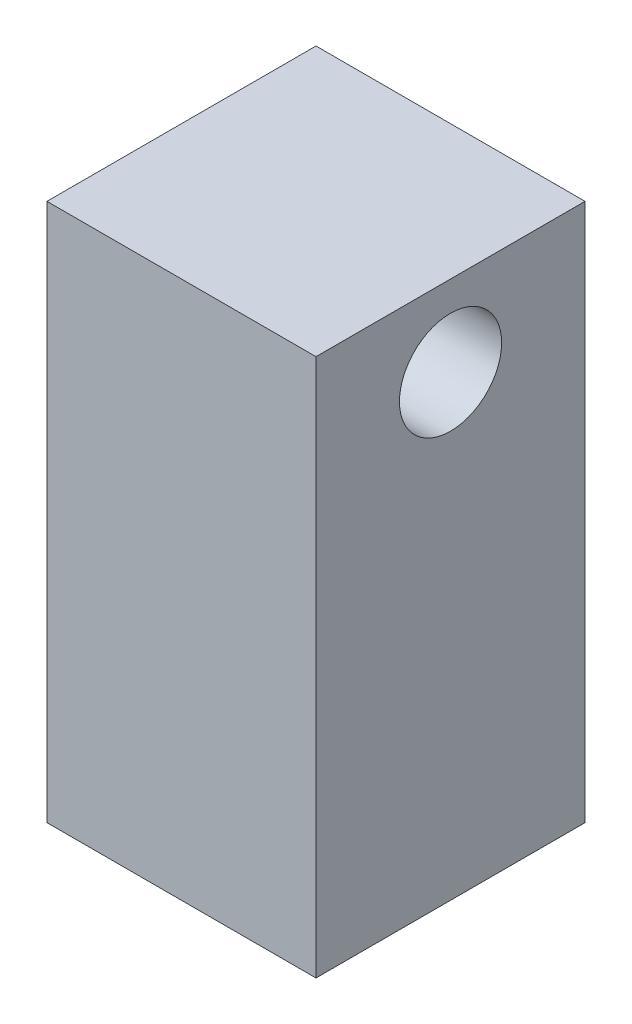
ISO-10303-21;
HEADER;
FILE_DESCRIPTION(('STEP AP214'),'2;1');
FILE_NAME('part.step','',(''),(''),'','','');
FILE_SCHEMA(('AUTOMOTIVE_DESIGN { 1 0 10303 214 1 1 1 1 }'));
ENDSEC;
DATA;
#1=APPLICATION_CONTEXT('core data for automotive mechanical design processes');
#2=APPLICATION_PROTOCOL_DEFINITION('international standard','automotive_design',2000,#1);
#3=PRODUCT_CONTEXT('',#1,'mechanical');
#4=PRODUCT('Part','Part','',(#3));
#5=PRODUCT_RELATED_PRODUCT_CATEGORY('part','',(#4));
#6=PRODUCT_DEFINITION_FORMATION('','',#4);
#7=PRODUCT_DEFINITION_CONTEXT('part definition',#1,'design');
#8=PRODUCT_DEFINITION('design','',#6,#7);
#9=PRODUCT_DEFINITION_SHAPE('','',#8);
#10=(LENGTH_UNIT() NAMED_UNIT(*) SI_UNIT(.MILLI.,.METRE.));
#11=(NAMED_UNIT(*) PLANE_ANGLE_UNIT() SI_UNIT($,.RADIAN.));
#12=(NAMED_UNIT(*) SI_UNIT($,.STERADIAN.) SOLID_ANGLE_UNIT());
#13=UNCERTAINTY_MEASURE_WITH_UNIT(LENGTH_MEASURE(1.E-05),#10,'distance_accuracy_value','');
#14=(GEOMETRIC_REPRESENTATION_CONTEXT(3) GLOBAL_UNCERTAINTY_ASSIGNED_CONTEXT((#13)) GLOBAL_UNIT_ASSIGNED_CONTEXT((#10,
#11,#12)) REPRESENTATION_CONTEXT('',''));
#15=CARTESIAN_POINT('',(0.,0.,0.));
#16=DIRECTION('',(0.,0.,1.));
#17=DIRECTION('',(1.,0.,0.));
#18=AXIS2_PLACEMENT_3D('',#15,#16,#17);
#19=CARTESIAN_POINT('',(14.8268379641413,-20.,51.1746931540809));
#20=DIRECTION('',(1.,0.,0.));
#21=DIRECTION('',(0.,0.,-1.));
#22=AXIS2_PLACEMENT_3D('',#19,#20,#21);
#23=PLANE('',#22);
#24=CARTESIAN_POINT('',(14.8268379641413,-3.,46.1746931540809));
#25=DIRECTION('',(1.,0.,0.));
#26=DIRECTION('',(0.,0.,-1.));
#27=AXIS2_PLACEMENT_3D('',#24,#25,#26);
#28=CIRCLE('',#27,1.89865);
#29=CARTESIAN_POINT('',(14.8268379641413,-3.,44.2760431540809));
#30=VERTEX_POINT('',#29);
#31=EDGE_CURVE('E145',#30,#30,#28,.T.);
#32=ORIENTED_EDGE('',*,*,#31,.F.);
#33=EDGE_LOOP('',(#32));
#34=FACE_BOUND('',#33,.T.);
#35=DIRECTION('',(0.,0.,-1.));
#36=VECTOR('',#35,1.);
#37=CARTESIAN_POINT('',(14.8268379641413,0.,51.1746931540809));
#38=LINE('',#37,#36);
#39=CARTESIAN_POINT('',(14.8268379641413,0.,51.1746931540809));
#40=VERTEX_POINT('',#39);
#41=CARTESIAN_POINT('',(14.8268379641413,0.,41.1746931540809));
#42=VERTEX_POINT('',#41);
#43=EDGE_CURVE('E148',#40,#42,#38,.T.);
#44=ORIENTED_EDGE('',*,*,#43,.F.);
#45=DIRECTION('',(0.,1.,0.));
#46=VECTOR('',#45,1.);
#47=CARTESIAN_POINT('',(14.8268379641413,-20.,51.1746931540809));
#48=LINE('',#47,#46);
#49=CARTESIAN_POINT('',(14.8268379641413,-20.,51.1746931540809));
#50=VERTEX_POINT('',#49);
#51=EDGE_CURVE('E11',#50,#40,#48,.T.);
#52=ORIENTED_EDGE('',*,*,#51,.F.);
#53=DIRECTION('',(0.,0.,-1.));
#54=VECTOR('',#53,1.);
#55=CARTESIAN_POINT('',(14.8268379641413,-20.,51.1746931540809));
#56=LINE('',#55,#54);
#57=CARTESIAN_POINT('',(14.8268379641413,-20.,41.1746931540809));
#58=VERTEX_POINT('',#57);
#59=EDGE_CURVE('E149',#50,#58,#56,.T.);
#60=ORIENTED_EDGE('',*,*,#59,.T.);
#61=DIRECTION('',(0.,1.,0.));
#62=VECTOR('',#61,1.);
#63=CARTESIAN_POINT('',(14.8268379641413,-20.,41.1746931540809));
#64=LINE('',#63,#62);
#65=EDGE_CURVE('E35',#58,#42,#64,.T.);
#66=ORIENTED_EDGE('',*,*,#65,.T.);
#67=EDGE_LOOP('',(#44,#52,#60,#66));
#68=FACE_BOUND('',#67,.T.);
#69=ADVANCED_FACE('F32',(#34,#68),#23,.T.);
#70=CARTESIAN_POINT('',(14.8268379641413,-20.,51.1746931540809));
#71=DIRECTION('',(0.,0.,1.));
#72=DIRECTION('',(1.,0.,0.));
#73=AXIS2_PLACEMENT_3D('',#70,#71,#72);
#74=PLANE('',#73);
#75=DIRECTION('',(1.,0.,0.));
#76=VECTOR('',#75,1.);
#77=CARTESIAN_POINT('',(14.8268379641413,0.,51.1746931540809));
#78=LINE('',#77,#76);
#79=CARTESIAN_POINT('',(4.82683796414131,0.,51.1746931540809));
#80=VERTEX_POINT('',#79);
#81=EDGE_CURVE('E152',#80,#40,#78,.T.);
#82=ORIENTED_EDGE('',*,*,#81,.F.);
#83=DIRECTION('',(0.,1.,0.));
#84=VECTOR('',#83,1.);
#85=CARTESIAN_POINT('',(4.82683796414131,-20.,51.1746931540809));
#86=LINE('',#85,#84);
#87=CARTESIAN_POINT('',(4.82683796414131,-20.,51.1746931540809));
#88=VERTEX_POINT('',#87);
#89=EDGE_CURVE('E40',#88,#80,#86,.T.);
#90=ORIENTED_EDGE('',*,*,#89,.F.);
#91=DIRECTION('',(1.,0.,0.));
#92=VECTOR('',#91,1.);
#93=CARTESIAN_POINT('',(14.8268379641413,-20.,51.1746931540809));
#94=LINE('',#93,#92);
#95=EDGE_CURVE('E157',#88,#50,#94,.T.);
#96=ORIENTED_EDGE('',*,*,#95,.T.);
#97=ORIENTED_EDGE('',*,*,#51,.T.);
#98=EDGE_LOOP('',(#82,#90,#96,#97));
#99=FACE_BOUND('',#98,.T.);
#100=ADVANCED_FACE('F174',(#99),#74,.T.);
#101=CARTESIAN_POINT('',(4.82683796414131,-20.,51.1746931540809));
#102=DIRECTION('',(-1.,0.,0.));
#103=DIRECTION('',(0.,0.,1.));
#104=AXIS2_PLACEMENT_3D('',#101,#102,#103);
#105=PLANE('',#104);
#106=DIRECTION('',(0.,-1.,0.));
#107=VECTOR('',#106,1.);
#108=CARTESIAN_POINT('',(4.8268379641413,-11.,42.6746931540809));
#109=LINE('',#108,#107);
#110=CARTESIAN_POINT('',(4.8268379641413,-11.,42.6746931540809));
#111=VERTEX_POINT('',#110);
#112=CARTESIAN_POINT('',(4.8268379641413,-18.,42.6746931540809));
#113=VERTEX_POINT('',#112);
#114=EDGE_CURVE('E48',#111,#113,#109,.T.);
#115=ORIENTED_EDGE('',*,*,#114,.F.);
#116=DIRECTION('',(0.,0.,-1.));
#117=VECTOR('',#116,1.);
#118=CARTESIAN_POINT('',(4.8268379641413,-11.,42.6746931540809));
#119=LINE('',#118,#117);
#120=CARTESIAN_POINT('',(4.82683796414131,-11.,49.6746931540809));
#121=VERTEX_POINT('',#120);
#122=EDGE_CURVE('E124',#121,#111,#119,.T.);
#123=ORIENTED_EDGE('',*,*,#122,.F.);
#124=DIRECTION('',(0.,1.,0.));
#125=VECTOR('',#124,1.);
#126=CARTESIAN_POINT('',(4.82683796414131,-11.,49.6746931540809));
#127=LINE('',#126,#125);
#128=CARTESIAN_POINT('',(4.82683796414131,-18.,49.6746931540809));
#129=VERTEX_POINT('',#128);
#130=EDGE_CURVE('E127',#129,#121,#127,.T.);
#131=ORIENTED_EDGE('',*,*,#130,.F.);
#132=DIRECTION('',(0.,0.,1.));
#133=VECTOR('',#132,1.);
#134=CARTESIAN_POINT('',(4.8268379641413,-18.,42.6746931540809));
#135=LINE('',#134,#133);
#136=EDGE_CURVE('E133',#113,#129,#135,.T.);
#137=ORIENTED_EDGE('',*,*,#136,.F.);
#138=EDGE_LOOP('',(#115,#123,#131,#137));
#139=FACE_BOUND('',#138,.T.);
#140=CARTESIAN_POINT('',(4.8268379641413,-3.,46.1746931540809));
#141=DIRECTION('',(-1.,0.,0.));
#142=DIRECTION('',(0.,0.,1.));
#143=AXIS2_PLACEMENT_3D('',#140,#141,#142);
#144=CIRCLE('',#143,1.89865);
#145=CARTESIAN_POINT('',(4.8268379641413,-3.,48.0733431540809));
#146=VERTEX_POINT('',#145);
#147=EDGE_CURVE('E139',#146,#146,#144,.T.);
#148=ORIENTED_EDGE('',*,*,#147,.F.);
#149=EDGE_LOOP('',(#148));
#150=FACE_BOUND('',#149,.T.);
#151=DIRECTION('',(0.,0.,1.));
#152=VECTOR('',#151,1.);
#153=CARTESIAN_POINT('',(4.82683796414131,0.,51.1746931540809));
#154=LINE('',#153,#152);
#155=CARTESIAN_POINT('',(4.8268379641413,0.,41.1746931540809));
#156=VERTEX_POINT('',#155);
#157=EDGE_CURVE('E164',#156,#80,#154,.T.);
#158=ORIENTED_EDGE('',*,*,#157,.F.);
#159=DIRECTION('',(0.,1.,0.));
#160=VECTOR('',#159,1.);
#161=CARTESIAN_POINT('',(4.8268379641413,-20.,41.1746931540809));
#162=LINE('',#161,#160);
#163=CARTESIAN_POINT('',(4.8268379641413,-20.,41.1746931540809));
#164=VERTEX_POINT('',#163);
#165=EDGE_CURVE('E169',#164,#156,#162,.T.);
#166=ORIENTED_EDGE('',*,*,#165,.F.);
#167=DIRECTION('',(0.,0.,1.));
#168=VECTOR('',#167,1.);
#169=CARTESIAN_POINT('',(4.82683796414131,-20.,51.1746931540809));
#170=LINE('',#169,#168);
#171=EDGE_CURVE('E154',#164,#88,#170,.T.);
#172=ORIENTED_EDGE('',*,*,#171,.T.);
#173=ORIENTED_EDGE('',*,*,#89,.T.);
#174=EDGE_LOOP('',(#158,#166,#172,#173));
#175=FACE_BOUND('',#174,.T.);
#176=ADVANCED_FACE('F178',(#139,#150,#175),#105,.T.);
#177=CARTESIAN_POINT('',(14.8268379641413,-20.,41.1746931540809));
#178=DIRECTION('',(0.,0.,-1.));
#179=DIRECTION('',(-1.,0.,0.));
#180=AXIS2_PLACEMENT_3D('',#177,#178,#179);
#181=PLANE('',#180);
#182=DIRECTION('',(-1.,0.,0.));
#183=VECTOR('',#182,1.);
#184=CARTESIAN_POINT('',(14.8268379641413,0.,41.1746931540809));
#185=LINE('',#184,#183);
#186=EDGE_CURVE('E161',#42,#156,#185,.T.);
#187=ORIENTED_EDGE('',*,*,#186,.F.);
#188=ORIENTED_EDGE('',*,*,#65,.F.);
#189=DIRECTION('',(-1.,0.,0.));
#190=VECTOR('',#189,1.);
#191=CARTESIAN_POINT('',(14.8268379641413,-20.,41.1746931540809));
#192=LINE('',#191,#190);
#193=EDGE_CURVE('E151',#58,#164,#192,.T.);
#194=ORIENTED_EDGE('',*,*,#193,.T.);
#195=ORIENTED_EDGE('',*,*,#165,.T.);
#196=EDGE_LOOP('',(#187,#188,#194,#195));
#197=FACE_BOUND('',#196,.T.);
#198=ADVANCED_FACE('F171',(#197),#181,.T.);
#199=CARTESIAN_POINT('',(0.,-20.,0.));
#200=DIRECTION('',(0.,1.,0.));
#201=DIRECTION('',(0.,0.,1.));
#202=AXIS2_PLACEMENT_3D('',#199,#200,#201);
#203=PLANE('',#202);
#204=ORIENTED_EDGE('',*,*,#59,.F.);
#205=ORIENTED_EDGE('',*,*,#95,.F.);
#206=ORIENTED_EDGE('',*,*,#171,.F.);
#207=ORIENTED_EDGE('',*,*,#193,.F.);
#208=EDGE_LOOP('',(#204,#205,#206,#207));
#209=FACE_BOUND('',#208,.T.);
#210=ADVANCED_FACE('F180',(#209),#203,.F.);
#211=CARTESIAN_POINT('',(0.,0.,0.));
#212=DIRECTION('',(0.,1.,0.));
#213=DIRECTION('',(0.,0.,1.));
#214=AXIS2_PLACEMENT_3D('',#211,#212,#213);
#215=PLANE('',#214);
#216=ORIENTED_EDGE('',*,*,#43,.T.);
#217=ORIENTED_EDGE('',*,*,#186,.T.);
#218=ORIENTED_EDGE('',*,*,#157,.T.);
#219=ORIENTED_EDGE('',*,*,#81,.T.);
#220=EDGE_LOOP('',(#216,#217,#218,#219));
#221=FACE_BOUND('',#220,.T.);
#222=ADVANCED_FACE('F173',(#221),#215,.T.);
#223=CARTESIAN_POINT('',(4.8268379641413,-3.,46.1746931540809));
#224=DIRECTION('',(-1.,0.,0.));
#225=DIRECTION('',(0.,0.,1.));
#226=AXIS2_PLACEMENT_3D('',#223,#224,#225);
#227=CYLINDRICAL_SURFACE('',#226,1.89865);
#228=ORIENTED_EDGE('',*,*,#31,.T.);
#229=EDGE_LOOP('',(#228));
#230=FACE_BOUND('',#229,.T.);
#231=ORIENTED_EDGE('',*,*,#147,.T.);
#232=EDGE_LOOP('',(#231));
#233=FACE_BOUND('',#232,.T.);
#234=ADVANCED_FACE('F187',(#230,#233),#227,.F.);
#235=CARTESIAN_POINT('',(11.8268379641413,-11.,42.6746931540809));
#236=DIRECTION('',(0.,0.,-1.));
#237=DIRECTION('',(-1.,0.,0.));
#238=AXIS2_PLACEMENT_3D('',#235,#236,#237);
#239=PLANE('',#238);
#240=ORIENTED_EDGE('',*,*,#114,.T.);
#241=DIRECTION('',(-1.,0.,0.));
#242=VECTOR('',#241,1.);
#243=CARTESIAN_POINT('',(11.8268379641413,-18.,42.6746931540809));
#244=LINE('',#243,#242);
#245=CARTESIAN_POINT('',(11.8268379641413,-18.,42.6746931540809));
#246=VERTEX_POINT('',#245);
#247=EDGE_CURVE('E102',#246,#113,#244,.T.);
#248=ORIENTED_EDGE('',*,*,#247,.F.);
#249=DIRECTION('',(0.,-1.,0.));
#250=VECTOR('',#249,1.);
#251=CARTESIAN_POINT('',(11.8268379641413,-11.,42.6746931540809));
#252=LINE('',#251,#250);
#253=CARTESIAN_POINT('',(11.8268379641413,-11.,42.6746931540809));
#254=VERTEX_POINT('',#253);
#255=EDGE_CURVE('E106',#254,#246,#252,.T.);
#256=ORIENTED_EDGE('',*,*,#255,.F.);
#257=DIRECTION('',(-1.,0.,0.));
#258=VECTOR('',#257,1.);
#259=CARTESIAN_POINT('',(11.8268379641413,-11.,42.6746931540809));
#260=LINE('',#259,#258);
#261=EDGE_CURVE('E137',#254,#111,#260,.T.);
#262=ORIENTED_EDGE('',*,*,#261,.T.);
#263=EDGE_LOOP('',(#240,#248,#256,#262));
#264=FACE_BOUND('',#263,.T.);
#265=ADVANCED_FACE('F104',(#264),#239,.F.);
#266=CARTESIAN_POINT('',(11.8268379641413,-11.,42.6746931540809));
#267=DIRECTION('',(0.,1.,0.));
#268=DIRECTION('',(0.,0.,1.));
#269=AXIS2_PLACEMENT_3D('',#266,#267,#268);
#270=PLANE('',#269);
#271=ORIENTED_EDGE('',*,*,#122,.T.);
#272=ORIENTED_EDGE('',*,*,#261,.F.);
#273=DIRECTION('',(0.,0.,-1.));
#274=VECTOR('',#273,1.);
#275=CARTESIAN_POINT('',(11.8268379641413,-11.,42.6746931540809));
#276=LINE('',#275,#274);
#277=CARTESIAN_POINT('',(11.8268379641413,-11.,49.6746931540809));
#278=VERTEX_POINT('',#277);
#279=EDGE_CURVE('E112',#278,#254,#276,.T.);
#280=ORIENTED_EDGE('',*,*,#279,.F.);
#281=DIRECTION('',(-1.,0.,0.));
#282=VECTOR('',#281,1.);
#283=CARTESIAN_POINT('',(11.8268379641413,-11.,49.6746931540809));
#284=LINE('',#283,#282);
#285=EDGE_CURVE('E140',#278,#121,#284,.T.);
#286=ORIENTED_EDGE('',*,*,#285,.T.);
#287=EDGE_LOOP('',(#271,#272,#280,#286));
#288=FACE_BOUND('',#287,.T.);
#289=ADVANCED_FACE('F212',(#288),#270,.F.);
#290=CARTESIAN_POINT('',(11.8268379641413,-11.,49.6746931540809));
#291=DIRECTION('',(0.,0.,1.));
#292=DIRECTION('',(1.,0.,0.));
#293=AXIS2_PLACEMENT_3D('',#290,#291,#292);
#294=PLANE('',#293);
#295=ORIENTED_EDGE('',*,*,#130,.T.);
#296=ORIENTED_EDGE('',*,*,#285,.F.);
#297=DIRECTION('',(0.,1.,0.));
#298=VECTOR('',#297,1.);
#299=CARTESIAN_POINT('',(11.8268379641413,-11.,49.6746931540809));
#300=LINE('',#299,#298);
#301=CARTESIAN_POINT('',(11.8268379641413,-18.,49.6746931540809));
#302=VERTEX_POINT('',#301);
#303=EDGE_CURVE('E120',#302,#278,#300,.T.);
#304=ORIENTED_EDGE('',*,*,#303,.F.);
#305=DIRECTION('',(-1.,0.,0.));
#306=VECTOR('',#305,1.);
#307=CARTESIAN_POINT('',(11.8268379641413,-18.,49.6746931540809));
#308=LINE('',#307,#306);
#309=EDGE_CURVE('E111',#302,#129,#308,.T.);
#310=ORIENTED_EDGE('',*,*,#309,.T.);
#311=EDGE_LOOP('',(#295,#296,#304,#310));
#312=FACE_BOUND('',#311,.T.);
#313=ADVANCED_FACE('F210',(#312),#294,.F.);
#314=CARTESIAN_POINT('',(11.8268379641413,-18.,42.6746931540809));
#315=DIRECTION('',(0.,-1.,0.));
#316=DIRECTION('',(0.,0.,-1.));
#317=AXIS2_PLACEMENT_3D('',#314,#315,#316);
#318=PLANE('',#317);
#319=ORIENTED_EDGE('',*,*,#136,.T.);
#320=ORIENTED_EDGE('',*,*,#309,.F.);
#321=DIRECTION('',(0.,0.,1.));
#322=VECTOR('',#321,1.);
#323=CARTESIAN_POINT('',(11.8268379641413,-18.,42.6746931540809));
#324=LINE('',#323,#322);
#325=EDGE_CURVE('E115',#246,#302,#324,.T.);
#326=ORIENTED_EDGE('',*,*,#325,.F.);
#327=ORIENTED_EDGE('',*,*,#247,.T.);
#328=EDGE_LOOP('',(#319,#320,#326,#327));
#329=FACE_BOUND('',#328,.T.);
#330=ADVANCED_FACE('F116',(#329),#318,.F.);
#331=CARTESIAN_POINT('',(11.8268379641413,0.,0.));
#332=DIRECTION('',(-1.,0.,0.));
#333=DIRECTION('',(0.,0.,1.));
#334=AXIS2_PLACEMENT_3D('',#331,#332,#333);
#335=PLANE('',#334);
#336=ORIENTED_EDGE('',*,*,#255,.T.);
#337=ORIENTED_EDGE('',*,*,#325,.T.);
#338=ORIENTED_EDGE('',*,*,#303,.T.);
#339=ORIENTED_EDGE('',*,*,#279,.T.);
#340=EDGE_LOOP('',(#336,#337,#338,#339));
#341=FACE_BOUND('',#340,.T.);
#342=ADVANCED_FACE('F122',(#341),#335,.T.);
#343=CLOSED_SHELL('',(#69,#100,#176,#198,#210,#222,#234,#265,#289,#313,#330,#342));
#344=MANIFOLD_SOLID_BREP('B2',#343);
#345=ADVANCED_BREP_SHAPE_REPRESENTATION('',(#18,#344),#14);
#346=SHAPE_DEFINITION_REPRESENTATION(#9,#345);
ENDSEC;
END-ISO-10303-21;
